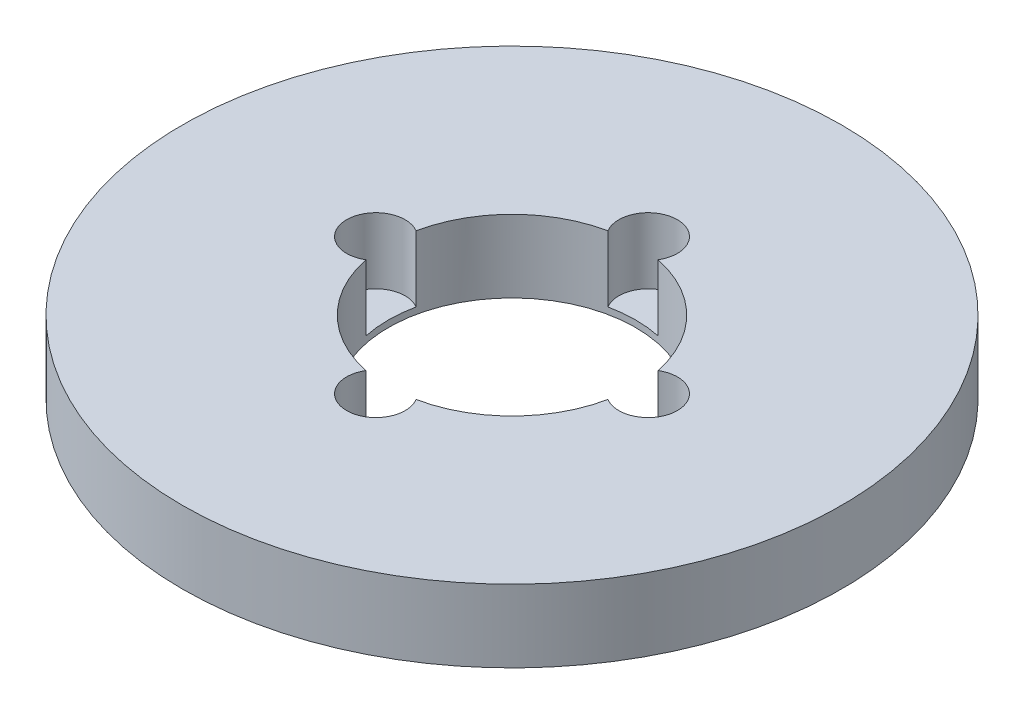
ISO-10303-21;
HEADER;
FILE_DESCRIPTION(('STEP AP214'),'2;1');
FILE_NAME('part.step','',(''),(''),'','','');
FILE_SCHEMA(('AUTOMOTIVE_DESIGN { 1 0 10303 214 1 1 1 1 }'));
ENDSEC;
DATA;
#1=APPLICATION_CONTEXT('core data for automotive mechanical design processes');
#2=APPLICATION_PROTOCOL_DEFINITION('international standard','automotive_design',2000,#1);
#3=PRODUCT_CONTEXT('',#1,'mechanical');
#4=PRODUCT('Part','Part','',(#3));
#5=PRODUCT_RELATED_PRODUCT_CATEGORY('part','',(#4));
#6=PRODUCT_DEFINITION_FORMATION('','',#4);
#7=PRODUCT_DEFINITION_CONTEXT('part definition',#1,'design');
#8=PRODUCT_DEFINITION('design','',#6,#7);
#9=PRODUCT_DEFINITION_SHAPE('','',#8);
#10=(LENGTH_UNIT() NAMED_UNIT(*) SI_UNIT(.MILLI.,.METRE.));
#11=(NAMED_UNIT(*) PLANE_ANGLE_UNIT() SI_UNIT($,.RADIAN.));
#12=(NAMED_UNIT(*) SI_UNIT($,.STERADIAN.) SOLID_ANGLE_UNIT());
#13=UNCERTAINTY_MEASURE_WITH_UNIT(LENGTH_MEASURE(1.E-05),#10,'distance_accuracy_value','');
#14=(GEOMETRIC_REPRESENTATION_CONTEXT(3) GLOBAL_UNCERTAINTY_ASSIGNED_CONTEXT((#13)) GLOBAL_UNIT_ASSIGNED_CONTEXT((#10,
#11,#12)) REPRESENTATION_CONTEXT('',''));
#15=CARTESIAN_POINT('',(0.,0.,0.));
#16=DIRECTION('',(0.,0.,1.));
#17=DIRECTION('',(1.,0.,0.));
#18=AXIS2_PLACEMENT_3D('',#15,#16,#17);
#19=CARTESIAN_POINT('',(0.,22.,0.));
#20=DIRECTION('',(0.,-1.,0.));
#21=DIRECTION('',(0.,0.,-1.));
#22=AXIS2_PLACEMENT_3D('',#19,#20,#21);
#23=CYLINDRICAL_SURFACE('',#22,100.);
#24=CARTESIAN_POINT('',(0.,22.,0.));
#25=DIRECTION('',(0.,1.,0.));
#26=DIRECTION('',(0.,0.,1.));
#27=AXIS2_PLACEMENT_3D('',#24,#25,#26);
#28=CIRCLE('',#27,100.);
#29=CARTESIAN_POINT('',(0.,22.,100.));
#30=VERTEX_POINT('',#29);
#31=EDGE_CURVE('E145',#30,#30,#28,.T.);
#32=ORIENTED_EDGE('',*,*,#31,.F.);
#33=EDGE_LOOP('',(#32));
#34=FACE_BOUND('',#33,.T.);
#35=CARTESIAN_POINT('',(0.,0.,0.));
#36=DIRECTION('',(0.,1.,0.));
#37=DIRECTION('',(0.,0.,1.));
#38=AXIS2_PLACEMENT_3D('',#35,#36,#37);
#39=CIRCLE('',#38,100.);
#40=CARTESIAN_POINT('',(0.,0.,100.));
#41=VERTEX_POINT('',#40);
#42=EDGE_CURVE('E143',#41,#41,#39,.T.);
#43=ORIENTED_EDGE('',*,*,#42,.T.);
#44=EDGE_LOOP('',(#43));
#45=FACE_BOUND('',#44,.T.);
#46=ADVANCED_FACE('F39',(#34,#45),#23,.T.);
#47=CARTESIAN_POINT('',(0.,22.,0.));
#48=DIRECTION('',(0.,1.,0.));
#49=DIRECTION('',(0.,0.,1.));
#50=AXIS2_PLACEMENT_3D('',#47,#48,#49);
#51=PLANE('',#50);
#52=CARTESIAN_POINT('',(1.44189591429829E-13,22.,41.2975403378797));
#53=DIRECTION('',(0.,1.,0.));
#54=DIRECTION('',(1.,0.,0.));
#55=AXIS2_PLACEMENT_3D('',#52,#53,#54);
#56=CIRCLE('',#55,8.87930367133914);
#57=CARTESIAN_POINT('',(-7.60845185610848,22.,36.7200416714535));
#58=VERTEX_POINT('',#57);
#59=CARTESIAN_POINT('',(7.60845185610874,22.,36.7200416714534));
#60=VERTEX_POINT('',#59);
#61=EDGE_CURVE('E152',#58,#60,#56,.T.);
#62=ORIENTED_EDGE('',*,*,#61,.F.);
#63=CARTESIAN_POINT('',(0.,22.,0.));
#64=DIRECTION('',(0.,1.,0.));
#65=DIRECTION('',(0.,0.,1.));
#66=AXIS2_PLACEMENT_3D('',#63,#64,#65);
#67=CIRCLE('',#66,37.5);
#68=CARTESIAN_POINT('',(-36.7200416714535,22.,7.60845185610861));
#69=VERTEX_POINT('',#68);
#70=EDGE_CURVE('E133',#69,#58,#67,.T.);
#71=ORIENTED_EDGE('',*,*,#70,.F.);
#72=CARTESIAN_POINT('',(-41.2975403378797,22.,0.));
#73=DIRECTION('',(0.,1.,0.));
#74=DIRECTION('',(0.,0.,1.));
#75=AXIS2_PLACEMENT_3D('',#72,#73,#74);
#76=CIRCLE('',#75,8.87930367133914);
#77=CARTESIAN_POINT('',(-36.7200416714535,22.,-7.60845185610861));
#78=VERTEX_POINT('',#77);
#79=EDGE_CURVE('E128',#78,#69,#76,.T.);
#80=ORIENTED_EDGE('',*,*,#79,.F.);
#81=CARTESIAN_POINT('',(-7.60845185610899,22.,-36.7200416714534));
#82=VERTEX_POINT('',#81);
#83=EDGE_CURVE('E121',#82,#78,#67,.T.);
#84=ORIENTED_EDGE('',*,*,#83,.F.);
#85=CARTESIAN_POINT('',(-4.32568774289486E-13,22.,-41.2975403378797));
#86=DIRECTION('',(0.,1.,0.));
#87=DIRECTION('',(-1.,0.,0.));
#88=AXIS2_PLACEMENT_3D('',#85,#86,#87);
#89=CIRCLE('',#88,8.87930367133914);
#90=CARTESIAN_POINT('',(7.60845185610822,22.,-36.7200416714535));
#91=VERTEX_POINT('',#90);
#92=EDGE_CURVE('E105',#91,#82,#89,.T.);
#93=ORIENTED_EDGE('',*,*,#92,.F.);
#94=CARTESIAN_POINT('',(36.7200416714535,22.,-7.60845185610861));
#95=VERTEX_POINT('',#94);
#96=EDGE_CURVE('E131',#95,#91,#67,.T.);
#97=ORIENTED_EDGE('',*,*,#96,.F.);
#98=CARTESIAN_POINT('',(41.2975403378797,22.,0.));
#99=DIRECTION('',(0.,1.,0.));
#100=DIRECTION('',(0.,0.,-1.));
#101=AXIS2_PLACEMENT_3D('',#98,#99,#100);
#102=CIRCLE('',#101,8.87930367133914);
#103=CARTESIAN_POINT('',(36.7200416714535,22.,7.60845185610861));
#104=VERTEX_POINT('',#103);
#105=EDGE_CURVE('E154',#104,#95,#102,.T.);
#106=ORIENTED_EDGE('',*,*,#105,.F.);
#107=EDGE_CURVE('E134',#60,#104,#67,.T.);
#108=ORIENTED_EDGE('',*,*,#107,.F.);
#109=EDGE_LOOP('',(#62,#71,#80,#84,#93,#97,#106,#108));
#110=FACE_BOUND('',#109,.T.);
#111=ORIENTED_EDGE('',*,*,#31,.T.);
#112=EDGE_LOOP('',(#111));
#113=FACE_BOUND('',#112,.T.);
#114=ADVANCED_FACE('F130',(#110,#113),#51,.T.);
#115=CARTESIAN_POINT('',(0.,0.,0.));
#116=DIRECTION('',(0.,1.,0.));
#117=DIRECTION('',(0.,0.,1.));
#118=AXIS2_PLACEMENT_3D('',#115,#116,#117);
#119=PLANE('',#118);
#120=CARTESIAN_POINT('',(0.,0.,0.));
#121=DIRECTION('',(0.,1.,0.));
#122=DIRECTION('',(0.,0.,1.));
#123=AXIS2_PLACEMENT_3D('',#120,#121,#122);
#124=CIRCLE('',#123,37.5);
#125=CARTESIAN_POINT('',(0.,0.,37.5));
#126=VERTEX_POINT('',#125);
#127=EDGE_CURVE('E135',#126,#126,#124,.T.);
#128=ORIENTED_EDGE('',*,*,#127,.T.);
#129=EDGE_LOOP('',(#128));
#130=FACE_BOUND('',#129,.T.);
#131=ORIENTED_EDGE('',*,*,#42,.F.);
#132=EDGE_LOOP('',(#131));
#133=FACE_BOUND('',#132,.T.);
#134=ADVANCED_FACE('F195',(#130,#133),#119,.F.);
#135=CARTESIAN_POINT('',(0.,22.,0.));
#136=DIRECTION('',(0.,-1.,0.));
#137=DIRECTION('',(0.,0.,-1.));
#138=AXIS2_PLACEMENT_3D('',#135,#136,#137);
#139=CYLINDRICAL_SURFACE('',#138,37.5);
#140=DIRECTION('',(0.,1.,0.));
#141=VECTOR('',#140,1.);
#142=CARTESIAN_POINT('',(-7.60845185610848,11.9967955751664,36.7200416714535));
#143=LINE('',#142,#141);
#144=CARTESIAN_POINT('',(-7.60845185610848,1.99359115033283,36.7200416714535));
#145=VERTEX_POINT('',#144);
#146=EDGE_CURVE('E11',#145,#58,#143,.T.);
#147=ORIENTED_EDGE('',*,*,#146,.F.);
#148=CARTESIAN_POINT('',(0.,1.99359115033283,0.));
#149=DIRECTION('',(0.,1.,0.));
#150=DIRECTION('',(0.,0.,1.));
#151=AXIS2_PLACEMENT_3D('',#148,#149,#150);
#152=CIRCLE('',#151,37.5);
#153=CARTESIAN_POINT('',(7.60845185610874,1.99359115033283,36.7200416714534));
#154=VERTEX_POINT('',#153);
#155=EDGE_CURVE('E169',#145,#154,#152,.T.);
#156=ORIENTED_EDGE('',*,*,#155,.T.);
#157=DIRECTION('',(0.,1.,0.));
#158=VECTOR('',#157,1.);
#159=CARTESIAN_POINT('',(7.60845185610874,11.9967955751664,36.7200416714534));
#160=LINE('',#159,#158);
#161=EDGE_CURVE('E46',#60,#154,#160,.F.);
#162=ORIENTED_EDGE('',*,*,#161,.F.);
#163=ORIENTED_EDGE('',*,*,#107,.T.);
#164=DIRECTION('',(0.,1.,0.));
#165=VECTOR('',#164,1.);
#166=CARTESIAN_POINT('',(36.7200416714535,11.9967955751664,7.60845185610861));
#167=LINE('',#166,#165);
#168=CARTESIAN_POINT('',(36.7200416714535,1.99359115033283,7.60845185610861));
#169=VERTEX_POINT('',#168);
#170=EDGE_CURVE('E151',#169,#104,#167,.T.);
#171=ORIENTED_EDGE('',*,*,#170,.F.);
#172=CARTESIAN_POINT('',(0.,1.99359115033283,0.));
#173=DIRECTION('',(0.,1.,0.));
#174=DIRECTION('',(0.,0.,1.));
#175=AXIS2_PLACEMENT_3D('',#172,#173,#174);
#176=CIRCLE('',#175,37.5);
#177=CARTESIAN_POINT('',(36.7200416714535,1.99359115033283,-7.60845185610861));
#178=VERTEX_POINT('',#177);
#179=EDGE_CURVE('E173',#169,#178,#176,.T.);
#180=ORIENTED_EDGE('',*,*,#179,.T.);
#181=DIRECTION('',(0.,1.,0.));
#182=VECTOR('',#181,1.);
#183=CARTESIAN_POINT('',(36.7200416714535,11.9967955751664,-7.60845185610861));
#184=LINE('',#183,#182);
#185=EDGE_CURVE('E168',#95,#178,#184,.F.);
#186=ORIENTED_EDGE('',*,*,#185,.F.);
#187=ORIENTED_EDGE('',*,*,#96,.T.);
#188=DIRECTION('',(0.,1.,0.));
#189=VECTOR('',#188,1.);
#190=CARTESIAN_POINT('',(7.60845185610822,11.9967955751664,-36.7200416714535));
#191=LINE('',#190,#189);
#192=CARTESIAN_POINT('',(7.60845185610822,1.99359115033283,-36.7200416714535));
#193=VERTEX_POINT('',#192);
#194=EDGE_CURVE('E108',#193,#91,#191,.T.);
#195=ORIENTED_EDGE('',*,*,#194,.F.);
#196=CARTESIAN_POINT('',(0.,1.99359115033283,0.));
#197=DIRECTION('',(0.,1.,0.));
#198=DIRECTION('',(0.,0.,1.));
#199=AXIS2_PLACEMENT_3D('',#196,#197,#198);
#200=CIRCLE('',#199,37.5);
#201=CARTESIAN_POINT('',(-7.60845185610899,1.99359115033283,-36.7200416714534));
#202=VERTEX_POINT('',#201);
#203=EDGE_CURVE('E122',#193,#202,#200,.T.);
#204=ORIENTED_EDGE('',*,*,#203,.T.);
#205=DIRECTION('',(0.,1.,0.));
#206=VECTOR('',#205,1.);
#207=CARTESIAN_POINT('',(-7.60845185610899,11.9967955751664,-36.7200416714534));
#208=LINE('',#207,#206);
#209=EDGE_CURVE('E106',#82,#202,#208,.F.);
#210=ORIENTED_EDGE('',*,*,#209,.F.);
#211=ORIENTED_EDGE('',*,*,#83,.T.);
#212=DIRECTION('',(0.,1.,0.));
#213=VECTOR('',#212,1.);
#214=CARTESIAN_POINT('',(-36.7200416714535,11.9967955751664,-7.60845185610861));
#215=LINE('',#214,#213);
#216=CARTESIAN_POINT('',(-36.7200416714535,1.99359115033283,-7.60845185610861));
#217=VERTEX_POINT('',#216);
#218=EDGE_CURVE('E177',#217,#78,#215,.T.);
#219=ORIENTED_EDGE('',*,*,#218,.F.);
#220=CARTESIAN_POINT('',(0.,1.99359115033283,0.));
#221=DIRECTION('',(0.,1.,0.));
#222=DIRECTION('',(0.,0.,1.));
#223=AXIS2_PLACEMENT_3D('',#220,#221,#222);
#224=CIRCLE('',#223,37.5);
#225=CARTESIAN_POINT('',(-36.7200416714535,1.99359115033283,7.60845185610861));
#226=VERTEX_POINT('',#225);
#227=EDGE_CURVE('E185',#217,#226,#224,.T.);
#228=ORIENTED_EDGE('',*,*,#227,.T.);
#229=DIRECTION('',(0.,1.,0.));
#230=VECTOR('',#229,1.);
#231=CARTESIAN_POINT('',(-36.7200416714535,11.9967955751664,7.60845185610861));
#232=LINE('',#231,#230);
#233=EDGE_CURVE('E179',#69,#226,#232,.F.);
#234=ORIENTED_EDGE('',*,*,#233,.F.);
#235=ORIENTED_EDGE('',*,*,#70,.T.);
#236=EDGE_LOOP('',(#147,#156,#162,#163,#171,#180,#186,#187,#195,#204,#210,#211,#219,#228,#234,#235));
#237=FACE_BOUND('',#236,.T.);
#238=ORIENTED_EDGE('',*,*,#127,.F.);
#239=EDGE_LOOP('',(#238));
#240=FACE_BOUND('',#239,.T.);
#241=ADVANCED_FACE('F117',(#237,#240),#139,.F.);
#242=CARTESIAN_POINT('',(-41.2975403378797,1.99359115033283,0.));
#243=DIRECTION('',(0.,1.,0.));
#244=DIRECTION('',(0.,0.,1.));
#245=AXIS2_PLACEMENT_3D('',#242,#243,#244);
#246=CYLINDRICAL_SURFACE('',#245,8.87930367133914);
#247=ORIENTED_EDGE('',*,*,#218,.T.);
#248=ORIENTED_EDGE('',*,*,#79,.T.);
#249=ORIENTED_EDGE('',*,*,#233,.T.);
#250=CARTESIAN_POINT('',(-41.2975403378797,1.99359115033283,0.));
#251=DIRECTION('',(0.,1.,0.));
#252=DIRECTION('',(0.,0.,1.));
#253=AXIS2_PLACEMENT_3D('',#250,#251,#252);
#254=CIRCLE('',#253,8.87930367133914);
#255=EDGE_CURVE('E140',#217,#226,#254,.T.);
#256=ORIENTED_EDGE('',*,*,#255,.F.);
#257=EDGE_LOOP('',(#247,#248,#249,#256));
#258=FACE_BOUND('',#257,.T.);
#259=ADVANCED_FACE('F200',(#258),#246,.F.);
#260=CARTESIAN_POINT('',(-41.2975403378797,1.99359115033283,0.));
#261=DIRECTION('',(0.,1.,0.));
#262=DIRECTION('',(0.,0.,1.));
#263=AXIS2_PLACEMENT_3D('',#260,#261,#262);
#264=PLANE('',#263);
#265=ORIENTED_EDGE('',*,*,#255,.T.);
#266=ORIENTED_EDGE('',*,*,#227,.F.);
#267=EDGE_LOOP('',(#265,#266));
#268=FACE_BOUND('',#267,.T.);
#269=ADVANCED_FACE('F202',(#268),#264,.T.);
#270=CARTESIAN_POINT('',(-4.32568774289486E-13,1.99359115033283,-41.2975403378797));
#271=DIRECTION('',(0.,1.,0.));
#272=DIRECTION('',(0.,0.,1.));
#273=AXIS2_PLACEMENT_3D('',#270,#271,#272);
#274=CYLINDRICAL_SURFACE('',#273,8.87930367133914);
#275=ORIENTED_EDGE('',*,*,#194,.T.);
#276=ORIENTED_EDGE('',*,*,#92,.T.);
#277=ORIENTED_EDGE('',*,*,#209,.T.);
#278=CARTESIAN_POINT('',(-4.32568774289486E-13,1.99359115033283,-41.2975403378797));
#279=DIRECTION('',(0.,1.,0.));
#280=DIRECTION('',(-1.,0.,0.));
#281=AXIS2_PLACEMENT_3D('',#278,#279,#280);
#282=CIRCLE('',#281,8.87930367133914);
#283=EDGE_CURVE('E111',#193,#202,#282,.T.);
#284=ORIENTED_EDGE('',*,*,#283,.F.);
#285=EDGE_LOOP('',(#275,#276,#277,#284));
#286=FACE_BOUND('',#285,.T.);
#287=ADVANCED_FACE('F102',(#286),#274,.F.);
#288=CARTESIAN_POINT('',(-4.32568774289486E-13,1.99359115033283,-41.2975403378797));
#289=DIRECTION('',(0.,1.,0.));
#290=DIRECTION('',(-1.,0.,0.));
#291=AXIS2_PLACEMENT_3D('',#288,#289,#290);
#292=PLANE('',#291);
#293=ORIENTED_EDGE('',*,*,#283,.T.);
#294=ORIENTED_EDGE('',*,*,#203,.F.);
#295=EDGE_LOOP('',(#293,#294));
#296=FACE_BOUND('',#295,.T.);
#297=ADVANCED_FACE('F211',(#296),#292,.T.);
#298=CARTESIAN_POINT('',(41.2975403378797,1.99359115033283,0.));
#299=DIRECTION('',(0.,1.,0.));
#300=DIRECTION('',(0.,0.,1.));
#301=AXIS2_PLACEMENT_3D('',#298,#299,#300);
#302=CYLINDRICAL_SURFACE('',#301,8.87930367133914);
#303=ORIENTED_EDGE('',*,*,#170,.T.);
#304=ORIENTED_EDGE('',*,*,#105,.T.);
#305=ORIENTED_EDGE('',*,*,#185,.T.);
#306=CARTESIAN_POINT('',(41.2975403378797,1.99359115033283,0.));
#307=DIRECTION('',(0.,1.,0.));
#308=DIRECTION('',(0.,0.,-1.));
#309=AXIS2_PLACEMENT_3D('',#306,#307,#308);
#310=CIRCLE('',#309,8.87930367133914);
#311=EDGE_CURVE('E56',#169,#178,#310,.T.);
#312=ORIENTED_EDGE('',*,*,#311,.F.);
#313=EDGE_LOOP('',(#303,#304,#305,#312));
#314=FACE_BOUND('',#313,.T.);
#315=ADVANCED_FACE('F212',(#314),#302,.F.);
#316=CARTESIAN_POINT('',(41.2975403378797,1.99359115033283,0.));
#317=DIRECTION('',(0.,1.,0.));
#318=DIRECTION('',(0.,0.,-1.));
#319=AXIS2_PLACEMENT_3D('',#316,#317,#318);
#320=PLANE('',#319);
#321=ORIENTED_EDGE('',*,*,#311,.T.);
#322=ORIENTED_EDGE('',*,*,#179,.F.);
#323=EDGE_LOOP('',(#321,#322));
#324=FACE_BOUND('',#323,.T.);
#325=ADVANCED_FACE('F217',(#324),#320,.T.);
#326=CARTESIAN_POINT('',(1.44189591429829E-13,1.99359115033283,41.2975403378797));
#327=DIRECTION('',(0.,1.,0.));
#328=DIRECTION('',(0.,0.,1.));
#329=AXIS2_PLACEMENT_3D('',#326,#327,#328);
#330=CYLINDRICAL_SURFACE('',#329,8.87930367133914);
#331=ORIENTED_EDGE('',*,*,#146,.T.);
#332=ORIENTED_EDGE('',*,*,#61,.T.);
#333=ORIENTED_EDGE('',*,*,#161,.T.);
#334=CARTESIAN_POINT('',(1.44189591429829E-13,1.99359115033283,41.2975403378797));
#335=DIRECTION('',(0.,1.,0.));
#336=DIRECTION('',(1.,0.,0.));
#337=AXIS2_PLACEMENT_3D('',#334,#335,#336);
#338=CIRCLE('',#337,8.87930367133914);
#339=EDGE_CURVE('E55',#145,#154,#338,.T.);
#340=ORIENTED_EDGE('',*,*,#339,.F.);
#341=EDGE_LOOP('',(#331,#332,#333,#340));
#342=FACE_BOUND('',#341,.T.);
#343=ADVANCED_FACE('F170',(#342),#330,.F.);
#344=CARTESIAN_POINT('',(1.44189591429829E-13,1.99359115033283,41.2975403378797));
#345=DIRECTION('',(0.,1.,0.));
#346=DIRECTION('',(1.,0.,0.));
#347=AXIS2_PLACEMENT_3D('',#344,#345,#346);
#348=PLANE('',#347);
#349=ORIENTED_EDGE('',*,*,#339,.T.);
#350=ORIENTED_EDGE('',*,*,#155,.F.);
#351=EDGE_LOOP('',(#349,#350));
#352=FACE_BOUND('',#351,.T.);
#353=ADVANCED_FACE('F224',(#352),#348,.T.);
#354=CLOSED_SHELL('',(#46,#114,#134,#241,#259,#269,#287,#297,#315,#325,#343,#353));
#355=MANIFOLD_SOLID_BREP('B2',#354);
#356=ADVANCED_BREP_SHAPE_REPRESENTATION('',(#18,#355),#14);
#357=SHAPE_DEFINITION_REPRESENTATION(#9,#356);
ENDSEC;
END-ISO-10303-21;
